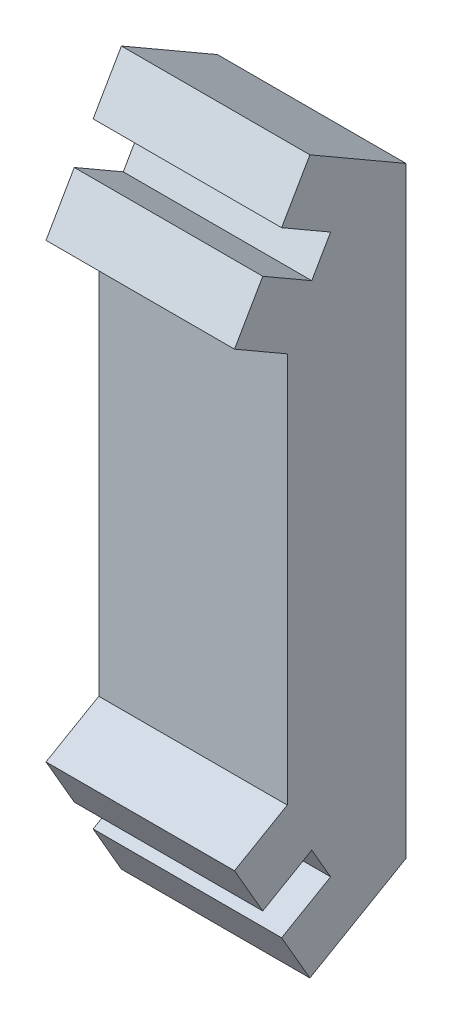
ISO-10303-21;
HEADER;
FILE_DESCRIPTION(('STEP AP214'),'2;1');
FILE_NAME('part.step','',(''),(''),'','','');
FILE_SCHEMA(('AUTOMOTIVE_DESIGN { 1 0 10303 214 1 1 1 1 }'));
ENDSEC;
DATA;
#1=APPLICATION_CONTEXT('core data for automotive mechanical design processes');
#2=APPLICATION_PROTOCOL_DEFINITION('international standard','automotive_design',2000,#1);
#3=PRODUCT_CONTEXT('',#1,'mechanical');
#4=PRODUCT('Part','Part','',(#3));
#5=PRODUCT_RELATED_PRODUCT_CATEGORY('part','',(#4));
#6=PRODUCT_DEFINITION_FORMATION('','',#4);
#7=PRODUCT_DEFINITION_CONTEXT('part definition',#1,'design');
#8=PRODUCT_DEFINITION('design','',#6,#7);
#9=PRODUCT_DEFINITION_SHAPE('','',#8);
#10=(LENGTH_UNIT() NAMED_UNIT(*) SI_UNIT(.MILLI.,.METRE.));
#11=(NAMED_UNIT(*) PLANE_ANGLE_UNIT() SI_UNIT($,.RADIAN.));
#12=(NAMED_UNIT(*) SI_UNIT($,.STERADIAN.) SOLID_ANGLE_UNIT());
#13=UNCERTAINTY_MEASURE_WITH_UNIT(LENGTH_MEASURE(1.E-05),#10,'distance_accuracy_value','');
#14=(GEOMETRIC_REPRESENTATION_CONTEXT(3) GLOBAL_UNCERTAINTY_ASSIGNED_CONTEXT((#13)) GLOBAL_UNIT_ASSIGNED_CONTEXT((#10,
#11,#12)) REPRESENTATION_CONTEXT('',''));
#15=CARTESIAN_POINT('',(0.,0.,0.));
#16=DIRECTION('',(0.,0.,1.));
#17=DIRECTION('',(1.,0.,0.));
#18=AXIS2_PLACEMENT_3D('',#15,#16,#17);
#19=CARTESIAN_POINT('',(10.,21.0468847374249,2.03984504792112));
#20=DIRECTION('',(0.,-0.500000000000018,-0.866025403784428));
#21=DIRECTION('',(0.,0.866025403784428,-0.500000000000018));
#22=AXIS2_PLACEMENT_3D('',#19,#20,#21);
#23=PLANE('',#22);
#24=DIRECTION('',(0.,-0.866025403784428,0.500000000000018));
#25=VECTOR('',#24,1.);
#26=CARTESIAN_POINT('',(0.,21.0468847374249,2.03984504792112));
#27=LINE('',#26,#25);
#28=CARTESIAN_POINT('',(0.,22.7789355449937,1.03984504792109));
#29=VERTEX_POINT('',#28);
#30=CARTESIAN_POINT('',(0.,21.0468847374249,2.03984504792112));
#31=VERTEX_POINT('',#30);
#32=EDGE_CURVE('E189',#29,#31,#27,.T.);
#33=ORIENTED_EDGE('',*,*,#32,.T.);
#34=DIRECTION('',(-1.,0.,0.));
#35=VECTOR('',#34,1.);
#36=CARTESIAN_POINT('',(10.,21.0468847374249,2.03984504792112));
#37=LINE('',#36,#35);
#38=CARTESIAN_POINT('',(10.,21.0468847374249,2.03984504792112));
#39=VERTEX_POINT('',#38);
#40=EDGE_CURVE('E11',#39,#31,#37,.T.);
#41=ORIENTED_EDGE('',*,*,#40,.F.);
#42=DIRECTION('',(0.,-0.866025403784428,0.500000000000018));
#43=VECTOR('',#42,1.);
#44=CARTESIAN_POINT('',(10.,21.0468847374249,2.03984504792112));
#45=LINE('',#44,#43);
#46=CARTESIAN_POINT('',(10.,22.7789355449937,1.03984504792109));
#47=VERTEX_POINT('',#46);
#48=EDGE_CURVE('E237',#47,#39,#45,.T.);
#49=ORIENTED_EDGE('',*,*,#48,.F.);
#50=DIRECTION('',(-1.,0.,0.));
#51=VECTOR('',#50,1.);
#52=CARTESIAN_POINT('',(10.,22.7789355449937,1.03984504792109));
#53=LINE('',#52,#51);
#54=EDGE_CURVE('E185',#47,#29,#53,.T.);
#55=ORIENTED_EDGE('',*,*,#54,.T.);
#56=EDGE_LOOP('',(#33,#41,#49,#55));
#57=FACE_BOUND('',#56,.T.);
#58=ADVANCED_FACE('F39',(#57),#23,.F.);
#59=CARTESIAN_POINT('',(10.,21.0468847374249,2.03984504792112));
#60=DIRECTION('',(0.,-0.866025403784433,0.50000000000001));
#61=DIRECTION('',(0.,-0.50000000000001,-0.866025403784433));
#62=AXIS2_PLACEMENT_3D('',#59,#60,#61);
#63=PLANE('',#62);
#64=DIRECTION('',(0.,0.50000000000001,0.866025403784433));
#65=VECTOR('',#64,1.);
#66=CARTESIAN_POINT('',(0.,21.0468847374249,2.03984504792112));
#67=LINE('',#66,#65);
#68=CARTESIAN_POINT('',(0.,22.5468847374249,4.63792125927442));
#69=VERTEX_POINT('',#68);
#70=EDGE_CURVE('E193',#31,#69,#67,.T.);
#71=ORIENTED_EDGE('',*,*,#70,.T.);
#72=DIRECTION('',(-1.,0.,0.));
#73=VECTOR('',#72,1.);
#74=CARTESIAN_POINT('',(10.,22.5468847374249,4.63792125927442));
#75=LINE('',#74,#73);
#76=CARTESIAN_POINT('',(10.,22.5468847374249,4.63792125927442));
#77=VERTEX_POINT('',#76);
#78=EDGE_CURVE('E48',#77,#69,#75,.T.);
#79=ORIENTED_EDGE('',*,*,#78,.F.);
#80=DIRECTION('',(0.,0.50000000000001,0.866025403784433));
#81=VECTOR('',#80,1.);
#82=CARTESIAN_POINT('',(10.,21.0468847374249,2.03984504792112));
#83=LINE('',#82,#81);
#84=EDGE_CURVE('E121',#39,#77,#83,.T.);
#85=ORIENTED_EDGE('',*,*,#84,.F.);
#86=ORIENTED_EDGE('',*,*,#40,.T.);
#87=EDGE_LOOP('',(#71,#79,#85,#86));
#88=FACE_BOUND('',#87,.T.);
#89=ADVANCED_FACE('F352',(#88),#63,.F.);
#90=CARTESIAN_POINT('',(10.,22.5468847374249,4.63792125927442));
#91=DIRECTION('',(0.,-0.50000000000001,-0.866025403784433));
#92=DIRECTION('',(0.,0.866025403784433,-0.50000000000001));
#93=AXIS2_PLACEMENT_3D('',#90,#91,#92);
#94=PLANE('',#93);
#95=DIRECTION('',(0.,-0.866025403784433,0.50000000000001));
#96=VECTOR('',#95,1.);
#97=CARTESIAN_POINT('',(0.,22.5468847374249,4.63792125927442));
#98=LINE('',#97,#96);
#99=CARTESIAN_POINT('',(0.,19.9488085260716,6.13792125927447));
#100=VERTEX_POINT('',#99);
#101=EDGE_CURVE('E196',#69,#100,#98,.T.);
#102=ORIENTED_EDGE('',*,*,#101,.T.);
#103=DIRECTION('',(-1.,0.,0.));
#104=VECTOR('',#103,1.);
#105=CARTESIAN_POINT('',(10.,19.9488085260716,6.13792125927447));
#106=LINE('',#105,#104);
#107=CARTESIAN_POINT('',(10.,19.9488085260716,6.13792125927447));
#108=VERTEX_POINT('',#107);
#109=EDGE_CURVE('E280',#108,#100,#106,.T.);
#110=ORIENTED_EDGE('',*,*,#109,.F.);
#111=DIRECTION('',(0.,-0.866025403784433,0.50000000000001));
#112=VECTOR('',#111,1.);
#113=CARTESIAN_POINT('',(10.,22.5468847374249,4.63792125927442));
#114=LINE('',#113,#112);
#115=EDGE_CURVE('E290',#77,#108,#114,.T.);
#116=ORIENTED_EDGE('',*,*,#115,.F.);
#117=ORIENTED_EDGE('',*,*,#78,.T.);
#118=EDGE_LOOP('',(#102,#110,#116,#117));
#119=FACE_BOUND('',#118,.T.);
#120=ADVANCED_FACE('F288',(#119),#94,.F.);
#121=CARTESIAN_POINT('',(10.,19.9488085260716,6.13792125927447));
#122=DIRECTION('',(0.,0.866025403784433,-0.50000000000001));
#123=DIRECTION('',(0.,0.50000000000001,0.866025403784433));
#124=AXIS2_PLACEMENT_3D('',#121,#122,#123);
#125=PLANE('',#124);
#126=DIRECTION('',(0.,-0.50000000000001,-0.866025403784433));
#127=VECTOR('',#126,1.);
#128=CARTESIAN_POINT('',(0.,19.9488085260716,6.13792125927447));
#129=LINE('',#128,#127);
#130=CARTESIAN_POINT('',(0.,18.3327831222871,3.33888315359777));
#131=VERTEX_POINT('',#130);
#132=EDGE_CURVE('E199',#100,#131,#129,.T.);
#133=ORIENTED_EDGE('',*,*,#132,.T.);
#134=DIRECTION('',(-1.,0.,0.));
#135=VECTOR('',#134,1.);
#136=CARTESIAN_POINT('',(10.,18.3327831222871,3.33888315359777));
#137=LINE('',#136,#135);
#138=CARTESIAN_POINT('',(10.,18.3327831222871,3.33888315359777));
#139=VERTEX_POINT('',#138);
#140=EDGE_CURVE('E276',#139,#131,#137,.T.);
#141=ORIENTED_EDGE('',*,*,#140,.F.);
#142=DIRECTION('',(0.,-0.50000000000001,-0.866025403784433));
#143=VECTOR('',#142,1.);
#144=CARTESIAN_POINT('',(10.,19.9488085260716,6.13792125927447));
#145=LINE('',#144,#143);
#146=EDGE_CURVE('E307',#108,#139,#145,.T.);
#147=ORIENTED_EDGE('',*,*,#146,.F.);
#148=ORIENTED_EDGE('',*,*,#109,.T.);
#149=EDGE_LOOP('',(#133,#141,#147,#148));
#150=FACE_BOUND('',#149,.T.);
#151=ADVANCED_FACE('F297',(#150),#125,.F.);
#152=CARTESIAN_POINT('',(10.,-2.39901364743735,3.33888315359777));
#153=DIRECTION('',(0.,0.,-1.));
#154=DIRECTION('',(0.,1.,0.));
#155=AXIS2_PLACEMENT_3D('',#152,#153,#154);
#156=PLANE('',#155);
#157=DIRECTION('',(0.,-1.,0.));
#158=VECTOR('',#157,1.);
#159=CARTESIAN_POINT('',(0.,-2.39901364743735,3.33888315359777));
#160=LINE('',#159,#158);
#161=CARTESIAN_POINT('',(0.,-2.39901364743735,3.33888315359777));
#162=VERTEX_POINT('',#161);
#163=EDGE_CURVE('E202',#131,#162,#160,.T.);
#164=ORIENTED_EDGE('',*,*,#163,.T.);
#165=DIRECTION('',(-1.,0.,0.));
#166=VECTOR('',#165,1.);
#167=CARTESIAN_POINT('',(10.,-2.39901364743735,3.33888315359777));
#168=LINE('',#167,#166);
#169=CARTESIAN_POINT('',(10.,-2.39901364743735,3.33888315359777));
#170=VERTEX_POINT('',#169);
#171=EDGE_CURVE('E272',#170,#162,#168,.T.);
#172=ORIENTED_EDGE('',*,*,#171,.F.);
#173=DIRECTION('',(0.,-1.,0.));
#174=VECTOR('',#173,1.);
#175=CARTESIAN_POINT('',(10.,-2.39901364743735,3.33888315359777));
#176=LINE('',#175,#174);
#177=EDGE_CURVE('E303',#139,#170,#176,.T.);
#178=ORIENTED_EDGE('',*,*,#177,.F.);
#179=ORIENTED_EDGE('',*,*,#140,.T.);
#180=EDGE_LOOP('',(#164,#172,#178,#179));
#181=FACE_BOUND('',#180,.T.);
#182=ADVANCED_FACE('F301',(#181),#156,.F.);
#183=CARTESIAN_POINT('',(10.,-4.01503905122186,6.13792125927446));
#184=DIRECTION('',(0.,-0.866025403784433,-0.50000000000001));
#185=DIRECTION('',(0.,0.50000000000001,-0.866025403784433));
#186=AXIS2_PLACEMENT_3D('',#183,#184,#185);
#187=PLANE('',#186);
#188=DIRECTION('',(0.,-0.50000000000001,0.866025403784433));
#189=VECTOR('',#188,1.);
#190=CARTESIAN_POINT('',(0.,-4.01503905122186,6.13792125927446));
#191=LINE('',#190,#189);
#192=CARTESIAN_POINT('',(0.,-4.01503905122186,6.13792125927446));
#193=VERTEX_POINT('',#192);
#194=EDGE_CURVE('E205',#162,#193,#191,.T.);
#195=ORIENTED_EDGE('',*,*,#194,.T.);
#196=DIRECTION('',(-1.,0.,0.));
#197=VECTOR('',#196,1.);
#198=CARTESIAN_POINT('',(10.,-4.01503905122186,6.13792125927446));
#199=LINE('',#198,#197);
#200=CARTESIAN_POINT('',(10.,-4.01503905122186,6.13792125927446));
#201=VERTEX_POINT('',#200);
#202=EDGE_CURVE('E268',#201,#193,#199,.T.);
#203=ORIENTED_EDGE('',*,*,#202,.F.);
#204=DIRECTION('',(0.,-0.50000000000001,0.866025403784433));
#205=VECTOR('',#204,1.);
#206=CARTESIAN_POINT('',(10.,-4.01503905122186,6.13792125927446));
#207=LINE('',#206,#205);
#208=EDGE_CURVE('E306',#170,#201,#207,.T.);
#209=ORIENTED_EDGE('',*,*,#208,.F.);
#210=ORIENTED_EDGE('',*,*,#171,.T.);
#211=EDGE_LOOP('',(#195,#203,#209,#210));
#212=FACE_BOUND('',#211,.T.);
#213=ADVANCED_FACE('F364',(#212),#187,.F.);
#214=CARTESIAN_POINT('',(10.,-6.61311526257515,4.63792125927442));
#215=DIRECTION('',(0.,0.500000000000013,-0.866025403784431));
#216=DIRECTION('',(0.,0.866025403784431,0.500000000000013));
#217=AXIS2_PLACEMENT_3D('',#214,#215,#216);
#218=PLANE('',#217);
#219=DIRECTION('',(0.,-0.866025403784431,-0.500000000000013));
#220=VECTOR('',#219,1.);
#221=CARTESIAN_POINT('',(0.,-6.61311526257515,4.63792125927442));
#222=LINE('',#221,#220);
#223=CARTESIAN_POINT('',(0.,-6.61311526257515,4.63792125927442));
#224=VERTEX_POINT('',#223);
#225=EDGE_CURVE('E208',#193,#224,#222,.T.);
#226=ORIENTED_EDGE('',*,*,#225,.T.);
#227=DIRECTION('',(-1.,0.,0.));
#228=VECTOR('',#227,1.);
#229=CARTESIAN_POINT('',(10.,-6.61311526257515,4.63792125927442));
#230=LINE('',#229,#228);
#231=CARTESIAN_POINT('',(10.,-6.61311526257515,4.63792125927442));
#232=VERTEX_POINT('',#231);
#233=EDGE_CURVE('E264',#232,#224,#230,.T.);
#234=ORIENTED_EDGE('',*,*,#233,.F.);
#235=DIRECTION('',(0.,-0.866025403784431,-0.500000000000013));
#236=VECTOR('',#235,1.);
#237=CARTESIAN_POINT('',(10.,-6.61311526257515,4.63792125927442));
#238=LINE('',#237,#236);
#239=EDGE_CURVE('E311',#201,#232,#238,.T.);
#240=ORIENTED_EDGE('',*,*,#239,.F.);
#241=ORIENTED_EDGE('',*,*,#202,.T.);
#242=EDGE_LOOP('',(#226,#234,#240,#241));
#243=FACE_BOUND('',#242,.T.);
#244=ADVANCED_FACE('F367',(#243),#218,.F.);
#245=CARTESIAN_POINT('',(10.,-5.11311526257512,2.03984504792112));
#246=DIRECTION('',(0.,0.866025403784433,0.50000000000001));
#247=DIRECTION('',(0.,-0.50000000000001,0.866025403784433));
#248=AXIS2_PLACEMENT_3D('',#245,#246,#247);
#249=PLANE('',#248);
#250=DIRECTION('',(0.,0.50000000000001,-0.866025403784433));
#251=VECTOR('',#250,1.);
#252=CARTESIAN_POINT('',(0.,-5.11311526257512,2.03984504792112));
#253=LINE('',#252,#251);
#254=CARTESIAN_POINT('',(0.,-5.11311526257512,2.03984504792112));
#255=VERTEX_POINT('',#254);
#256=EDGE_CURVE('E211',#224,#255,#253,.T.);
#257=ORIENTED_EDGE('',*,*,#256,.T.);
#258=DIRECTION('',(-1.,0.,0.));
#259=VECTOR('',#258,1.);
#260=CARTESIAN_POINT('',(10.,-5.11311526257512,2.03984504792112));
#261=LINE('',#260,#259);
#262=CARTESIAN_POINT('',(10.,-5.11311526257512,2.03984504792112));
#263=VERTEX_POINT('',#262);
#264=EDGE_CURVE('E260',#263,#255,#261,.T.);
#265=ORIENTED_EDGE('',*,*,#264,.F.);
#266=DIRECTION('',(0.,0.50000000000001,-0.866025403784433));
#267=VECTOR('',#266,1.);
#268=CARTESIAN_POINT('',(10.,-5.11311526257512,2.03984504792112));
#269=LINE('',#268,#267);
#270=EDGE_CURVE('E318',#232,#263,#269,.T.);
#271=ORIENTED_EDGE('',*,*,#270,.F.);
#272=ORIENTED_EDGE('',*,*,#233,.T.);
#273=EDGE_LOOP('',(#257,#265,#271,#272));
#274=FACE_BOUND('',#273,.T.);
#275=ADVANCED_FACE('F371',(#274),#249,.F.);
#276=CARTESIAN_POINT('',(10.,-5.11311526257512,2.03984504792112));
#277=DIRECTION('',(0.,0.500000000000013,-0.866025403784431));
#278=DIRECTION('',(0.,0.866025403784431,0.500000000000013));
#279=AXIS2_PLACEMENT_3D('',#276,#277,#278);
#280=PLANE('',#279);
#281=DIRECTION('',(0.,-0.866025403784431,-0.500000000000013));
#282=VECTOR('',#281,1.);
#283=CARTESIAN_POINT('',(0.,-5.11311526257512,2.03984504792112));
#284=LINE('',#283,#282);
#285=CARTESIAN_POINT('',(0.,-6.845166070144,1.03984504792109));
#286=VERTEX_POINT('',#285);
#287=EDGE_CURVE('E214',#255,#286,#284,.T.);
#288=ORIENTED_EDGE('',*,*,#287,.T.);
#289=DIRECTION('',(-1.,0.,0.));
#290=VECTOR('',#289,1.);
#291=CARTESIAN_POINT('',(10.,-6.845166070144,1.03984504792109));
#292=LINE('',#291,#290);
#293=CARTESIAN_POINT('',(10.,-6.845166070144,1.03984504792109));
#294=VERTEX_POINT('',#293);
#295=EDGE_CURVE('E256',#294,#286,#292,.T.);
#296=ORIENTED_EDGE('',*,*,#295,.F.);
#297=DIRECTION('',(0.,-0.866025403784431,-0.500000000000013));
#298=VECTOR('',#297,1.);
#299=CARTESIAN_POINT('',(10.,-5.11311526257512,2.03984504792112));
#300=LINE('',#299,#298);
#301=EDGE_CURVE('E321',#263,#294,#300,.T.);
#302=ORIENTED_EDGE('',*,*,#301,.F.);
#303=ORIENTED_EDGE('',*,*,#264,.T.);
#304=EDGE_LOOP('',(#288,#296,#302,#303));
#305=FACE_BOUND('',#304,.T.);
#306=ADVANCED_FACE('F375',(#305),#280,.F.);
#307=CARTESIAN_POINT('',(10.,-7.59516607014402,2.33888315359774));
#308=DIRECTION('',(0.,-0.866025403784433,-0.500000000000009));
#309=DIRECTION('',(0.,0.500000000000009,-0.866025403784433));
#310=AXIS2_PLACEMENT_3D('',#307,#308,#309);
#311=PLANE('',#310);
#312=DIRECTION('',(0.,-0.500000000000009,0.866025403784433));
#313=VECTOR('',#312,1.);
#314=CARTESIAN_POINT('',(0.,-7.59516607014402,2.33888315359774));
#315=LINE('',#314,#313);
#316=CARTESIAN_POINT('',(0.,-8.34516607014403,3.63792125927438));
#317=VERTEX_POINT('',#316);
#318=EDGE_CURVE('E218',#286,#317,#315,.T.);
#319=ORIENTED_EDGE('',*,*,#318,.T.);
#320=DIRECTION('',(-1.,0.,0.));
#321=VECTOR('',#320,1.);
#322=CARTESIAN_POINT('',(10.,-8.34516607014403,3.63792125927438));
#323=LINE('',#322,#321);
#324=CARTESIAN_POINT('',(10.,-8.34516607014403,3.63792125927438));
#325=VERTEX_POINT('',#324);
#326=EDGE_CURVE('E252',#325,#317,#323,.T.);
#327=ORIENTED_EDGE('',*,*,#326,.F.);
#328=DIRECTION('',(0.,-0.500000000000011,0.866025403784432));
#329=VECTOR('',#328,1.);
#330=CARTESIAN_POINT('',(10.,-7.59516607014402,2.33888315359774));
#331=LINE('',#330,#329);
#332=EDGE_CURVE('E324',#294,#325,#331,.T.);
#333=ORIENTED_EDGE('',*,*,#332,.F.);
#334=ORIENTED_EDGE('',*,*,#295,.T.);
#335=EDGE_LOOP('',(#319,#327,#333,#334));
#336=FACE_BOUND('',#335,.T.);
#337=ADVANCED_FACE('F379',(#336),#311,.F.);
#338=CARTESIAN_POINT('',(10.,-8.34516607014403,3.63792125927438));
#339=DIRECTION('',(0.,0.500000000000011,-0.866025403784433));
#340=DIRECTION('',(0.,0.866025403784433,0.500000000000011));
#341=AXIS2_PLACEMENT_3D('',#338,#339,#340);
#342=PLANE('',#341);
#343=DIRECTION('',(0.,-0.866025403784433,-0.500000000000011));
#344=VECTOR('',#343,1.);
#345=CARTESIAN_POINT('',(0.,-8.34516607014403,3.63792125927438));
#346=LINE('',#345,#344);
#347=CARTESIAN_POINT('',(0.,-10.9432422814973,2.13792125927435));
#348=VERTEX_POINT('',#347);
#349=EDGE_CURVE('E221',#317,#348,#346,.T.);
#350=ORIENTED_EDGE('',*,*,#349,.T.);
#351=DIRECTION('',(-1.,0.,0.));
#352=VECTOR('',#351,1.);
#353=CARTESIAN_POINT('',(10.,-10.9432422814973,2.13792125927435));
#354=LINE('',#353,#352);
#355=CARTESIAN_POINT('',(10.,-10.9432422814973,2.13792125927435));
#356=VERTEX_POINT('',#355);
#357=EDGE_CURVE('E248',#356,#348,#354,.T.);
#358=ORIENTED_EDGE('',*,*,#357,.F.);
#359=DIRECTION('',(0.,-0.866025403784433,-0.500000000000011));
#360=VECTOR('',#359,1.);
#361=CARTESIAN_POINT('',(10.,-8.34516607014403,3.63792125927438));
#362=LINE('',#361,#360);
#363=EDGE_CURVE('E327',#325,#356,#362,.T.);
#364=ORIENTED_EDGE('',*,*,#363,.F.);
#365=ORIENTED_EDGE('',*,*,#326,.T.);
#366=EDGE_LOOP('',(#350,#358,#364,#365));
#367=FACE_BOUND('',#366,.T.);
#368=ADVANCED_FACE('F383',(#367),#342,.F.);
#369=CARTESIAN_POINT('',(10.,-10.9432422814973,2.13792125927435));
#370=DIRECTION('',(0.,0.866025403784438,0.5));
#371=DIRECTION('',(0.,-0.5,0.866025403784438));
#372=AXIS2_PLACEMENT_3D('',#369,#370,#371);
#373=PLANE('',#372);
#374=DIRECTION('',(0.,0.5,-0.866025403784438));
#375=VECTOR('',#374,1.);
#376=CARTESIAN_POINT('',(0.,-10.9432422814973,2.13792125927435));
#377=LINE('',#376,#375);
#378=CARTESIAN_POINT('',(0.,-7.99986660852329,-2.96015495207891));
#379=VERTEX_POINT('',#378);
#380=EDGE_CURVE('E224',#348,#379,#377,.T.);
#381=ORIENTED_EDGE('',*,*,#380,.T.);
#382=DIRECTION('',(-1.,0.,0.));
#383=VECTOR('',#382,1.);
#384=CARTESIAN_POINT('',(10.,-7.99986660852329,-2.96015495207891));
#385=LINE('',#384,#383);
#386=CARTESIAN_POINT('',(10.,-7.99986660852329,-2.96015495207891));
#387=VERTEX_POINT('',#386);
#388=EDGE_CURVE('E244',#387,#379,#385,.T.);
#389=ORIENTED_EDGE('',*,*,#388,.F.);
#390=DIRECTION('',(0.,0.5,-0.866025403784438));
#391=VECTOR('',#390,1.);
#392=CARTESIAN_POINT('',(10.,-10.9432422814973,2.13792125927435));
#393=LINE('',#392,#391);
#394=EDGE_CURVE('E330',#356,#387,#393,.T.);
#395=ORIENTED_EDGE('',*,*,#394,.F.);
#396=ORIENTED_EDGE('',*,*,#357,.T.);
#397=EDGE_LOOP('',(#381,#389,#395,#396));
#398=FACE_BOUND('',#397,.T.);
#399=ADVANCED_FACE('F338',(#398),#373,.F.);
#400=CARTESIAN_POINT('',(10.,-7.99986660852329,-2.96015495207891));
#401=DIRECTION('',(0.,0.,1.));
#402=DIRECTION('',(0.,-1.,0.));
#403=AXIS2_PLACEMENT_3D('',#400,#401,#402);
#404=PLANE('',#403);
#405=DIRECTION('',(0.,1.,0.));
#406=VECTOR('',#405,1.);
#407=CARTESIAN_POINT('',(0.,-7.99986660852329,-2.96015495207891));
#408=LINE('',#407,#406);
#409=CARTESIAN_POINT('',(0.,23.933636083373,-2.96015495207891));
#410=VERTEX_POINT('',#409);
#411=EDGE_CURVE('E227',#379,#410,#408,.T.);
#412=ORIENTED_EDGE('',*,*,#411,.T.);
#413=DIRECTION('',(-1.,0.,0.));
#414=VECTOR('',#413,1.);
#415=CARTESIAN_POINT('',(10.,23.933636083373,-2.96015495207891));
#416=LINE('',#415,#414);
#417=CARTESIAN_POINT('',(10.,23.933636083373,-2.96015495207891));
#418=VERTEX_POINT('',#417);
#419=EDGE_CURVE('E178',#418,#410,#416,.T.);
#420=ORIENTED_EDGE('',*,*,#419,.F.);
#421=DIRECTION('',(0.,1.,0.));
#422=VECTOR('',#421,1.);
#423=CARTESIAN_POINT('',(10.,-7.99986660852329,-2.96015495207891));
#424=LINE('',#423,#422);
#425=EDGE_CURVE('E165',#387,#418,#424,.T.);
#426=ORIENTED_EDGE('',*,*,#425,.F.);
#427=ORIENTED_EDGE('',*,*,#388,.T.);
#428=EDGE_LOOP('',(#412,#420,#426,#427));
#429=FACE_BOUND('',#428,.T.);
#430=ADVANCED_FACE('F342',(#429),#404,.F.);
#431=CARTESIAN_POINT('',(10.,26.8770117563471,2.13792125927435));
#432=DIRECTION('',(0.,-0.866025403784438,0.5));
#433=DIRECTION('',(0.,-0.5,-0.866025403784438));
#434=AXIS2_PLACEMENT_3D('',#431,#432,#433);
#435=PLANE('',#434);
#436=DIRECTION('',(0.,0.5,0.866025403784438));
#437=VECTOR('',#436,1.);
#438=CARTESIAN_POINT('',(0.,26.8770117563471,2.13792125927435));
#439=LINE('',#438,#437);
#440=CARTESIAN_POINT('',(0.,26.8770117563471,2.13792125927435));
#441=VERTEX_POINT('',#440);
#442=EDGE_CURVE('E175',#410,#441,#439,.T.);
#443=ORIENTED_EDGE('',*,*,#442,.T.);
#444=DIRECTION('',(-1.,0.,0.));
#445=VECTOR('',#444,1.);
#446=CARTESIAN_POINT('',(10.,26.8770117563471,2.13792125927435));
#447=LINE('',#446,#445);
#448=CARTESIAN_POINT('',(10.,26.8770117563471,2.13792125927435));
#449=VERTEX_POINT('',#448);
#450=EDGE_CURVE('E172',#449,#441,#447,.T.);
#451=ORIENTED_EDGE('',*,*,#450,.F.);
#452=DIRECTION('',(0.,0.5,0.866025403784438));
#453=VECTOR('',#452,1.);
#454=CARTESIAN_POINT('',(10.,26.8770117563471,2.13792125927435));
#455=LINE('',#454,#453);
#456=EDGE_CURVE('E158',#418,#449,#455,.T.);
#457=ORIENTED_EDGE('',*,*,#456,.F.);
#458=ORIENTED_EDGE('',*,*,#419,.T.);
#459=EDGE_LOOP('',(#443,#451,#457,#458));
#460=FACE_BOUND('',#459,.T.);
#461=ADVANCED_FACE('F173',(#460),#435,.F.);
#462=CARTESIAN_POINT('',(10.,24.2789355449938,3.63792125927439));
#463=DIRECTION('',(0.,-0.500000000000011,-0.866025403784433));
#464=DIRECTION('',(0.,0.866025403784433,-0.500000000000011));
#465=AXIS2_PLACEMENT_3D('',#462,#463,#464);
#466=PLANE('',#465);
#467=DIRECTION('',(0.,-0.866025403784433,0.500000000000011));
#468=VECTOR('',#467,1.);
#469=CARTESIAN_POINT('',(0.,24.2789355449938,3.63792125927439));
#470=LINE('',#469,#468);
#471=CARTESIAN_POINT('',(0.,24.2789355449938,3.63792125927439));
#472=VERTEX_POINT('',#471);
#473=EDGE_CURVE('E232',#441,#472,#470,.T.);
#474=ORIENTED_EDGE('',*,*,#473,.T.);
#475=DIRECTION('',(-1.,0.,0.));
#476=VECTOR('',#475,1.);
#477=CARTESIAN_POINT('',(10.,24.2789355449938,3.63792125927439));
#478=LINE('',#477,#476);
#479=CARTESIAN_POINT('',(10.,24.2789355449938,3.63792125927439));
#480=VERTEX_POINT('',#479);
#481=EDGE_CURVE('E179',#480,#472,#478,.T.);
#482=ORIENTED_EDGE('',*,*,#481,.F.);
#483=DIRECTION('',(0.,-0.866025403784433,0.500000000000011));
#484=VECTOR('',#483,1.);
#485=CARTESIAN_POINT('',(10.,24.2789355449938,3.63792125927439));
#486=LINE('',#485,#484);
#487=EDGE_CURVE('E162',#449,#480,#486,.T.);
#488=ORIENTED_EDGE('',*,*,#487,.F.);
#489=ORIENTED_EDGE('',*,*,#450,.T.);
#490=EDGE_LOOP('',(#474,#482,#488,#489));
#491=FACE_BOUND('',#490,.T.);
#492=ADVANCED_FACE('F181',(#491),#466,.F.);
#493=CARTESIAN_POINT('',(10.,23.5289355449938,2.33888315359774));
#494=DIRECTION('',(0.,0.866025403784432,-0.500000000000011));
#495=DIRECTION('',(0.,0.500000000000011,0.866025403784432));
#496=AXIS2_PLACEMENT_3D('',#493,#494,#495);
#497=PLANE('',#496);
#498=DIRECTION('',(0.,-0.500000000000011,-0.866025403784432));
#499=VECTOR('',#498,1.);
#500=CARTESIAN_POINT('',(0.,23.5289355449938,2.33888315359774));
#501=LINE('',#500,#499);
#502=EDGE_CURVE('E109',#472,#29,#501,.T.);
#503=ORIENTED_EDGE('',*,*,#502,.T.);
#504=ORIENTED_EDGE('',*,*,#54,.F.);
#505=DIRECTION('',(0.,-0.500000000000009,-0.866025403784433));
#506=VECTOR('',#505,1.);
#507=CARTESIAN_POINT('',(10.,23.5289355449938,2.33888315359774));
#508=LINE('',#507,#506);
#509=EDGE_CURVE('E56',#480,#47,#508,.T.);
#510=ORIENTED_EDGE('',*,*,#509,.F.);
#511=ORIENTED_EDGE('',*,*,#481,.T.);
#512=EDGE_LOOP('',(#503,#504,#510,#511));
#513=FACE_BOUND('',#512,.T.);
#514=ADVANCED_FACE('F343',(#513),#497,.F.);
#515=CARTESIAN_POINT('',(10.,0.,0.));
#516=DIRECTION('',(-1.,0.,0.));
#517=DIRECTION('',(0.,0.,1.));
#518=AXIS2_PLACEMENT_3D('',#515,#516,#517);
#519=PLANE('',#518);
#520=ORIENTED_EDGE('',*,*,#48,.T.);
#521=ORIENTED_EDGE('',*,*,#84,.T.);
#522=ORIENTED_EDGE('',*,*,#115,.T.);
#523=ORIENTED_EDGE('',*,*,#146,.T.);
#524=ORIENTED_EDGE('',*,*,#177,.T.);
#525=ORIENTED_EDGE('',*,*,#208,.T.);
#526=ORIENTED_EDGE('',*,*,#239,.T.);
#527=ORIENTED_EDGE('',*,*,#270,.T.);
#528=ORIENTED_EDGE('',*,*,#301,.T.);
#529=ORIENTED_EDGE('',*,*,#332,.T.);
#530=ORIENTED_EDGE('',*,*,#363,.T.);
#531=ORIENTED_EDGE('',*,*,#394,.T.);
#532=ORIENTED_EDGE('',*,*,#425,.T.);
#533=ORIENTED_EDGE('',*,*,#456,.T.);
#534=ORIENTED_EDGE('',*,*,#487,.T.);
#535=ORIENTED_EDGE('',*,*,#509,.T.);
#536=EDGE_LOOP('',(#520,#521,#522,#523,#524,#525,#526,#527,#528,#529,#530,#531,#532,#533,#534,#535));
#537=FACE_BOUND('',#536,.T.);
#538=ADVANCED_FACE('F160',(#537),#519,.F.);
#539=CARTESIAN_POINT('',(0.,0.,0.));
#540=DIRECTION('',(-1.,0.,0.));
#541=DIRECTION('',(0.,0.,1.));
#542=AXIS2_PLACEMENT_3D('',#539,#540,#541);
#543=PLANE('',#542);
#544=ORIENTED_EDGE('',*,*,#32,.F.);
#545=ORIENTED_EDGE('',*,*,#502,.F.);
#546=ORIENTED_EDGE('',*,*,#473,.F.);
#547=ORIENTED_EDGE('',*,*,#442,.F.);
#548=ORIENTED_EDGE('',*,*,#411,.F.);
#549=ORIENTED_EDGE('',*,*,#380,.F.);
#550=ORIENTED_EDGE('',*,*,#349,.F.);
#551=ORIENTED_EDGE('',*,*,#318,.F.);
#552=ORIENTED_EDGE('',*,*,#287,.F.);
#553=ORIENTED_EDGE('',*,*,#256,.F.);
#554=ORIENTED_EDGE('',*,*,#225,.F.);
#555=ORIENTED_EDGE('',*,*,#194,.F.);
#556=ORIENTED_EDGE('',*,*,#163,.F.);
#557=ORIENTED_EDGE('',*,*,#132,.F.);
#558=ORIENTED_EDGE('',*,*,#101,.F.);
#559=ORIENTED_EDGE('',*,*,#70,.F.);
#560=EDGE_LOOP('',(#544,#545,#546,#547,#548,#549,#550,#551,#552,#553,#554,#555,#556,#557,#558,#559));
#561=FACE_BOUND('',#560,.T.);
#562=ADVANCED_FACE('F292',(#561),#543,.T.);
#563=CLOSED_SHELL('',(#58,#89,#120,#151,#182,#213,#244,#275,#306,#337,#368,#399,#430,#461,#492,
#514,#538,#562));
#564=MANIFOLD_SOLID_BREP('B2',#563);
#565=ADVANCED_BREP_SHAPE_REPRESENTATION('',(#18,#564),#14);
#566=SHAPE_DEFINITION_REPRESENTATION(#9,#565);
ENDSEC;
END-ISO-10303-21;
